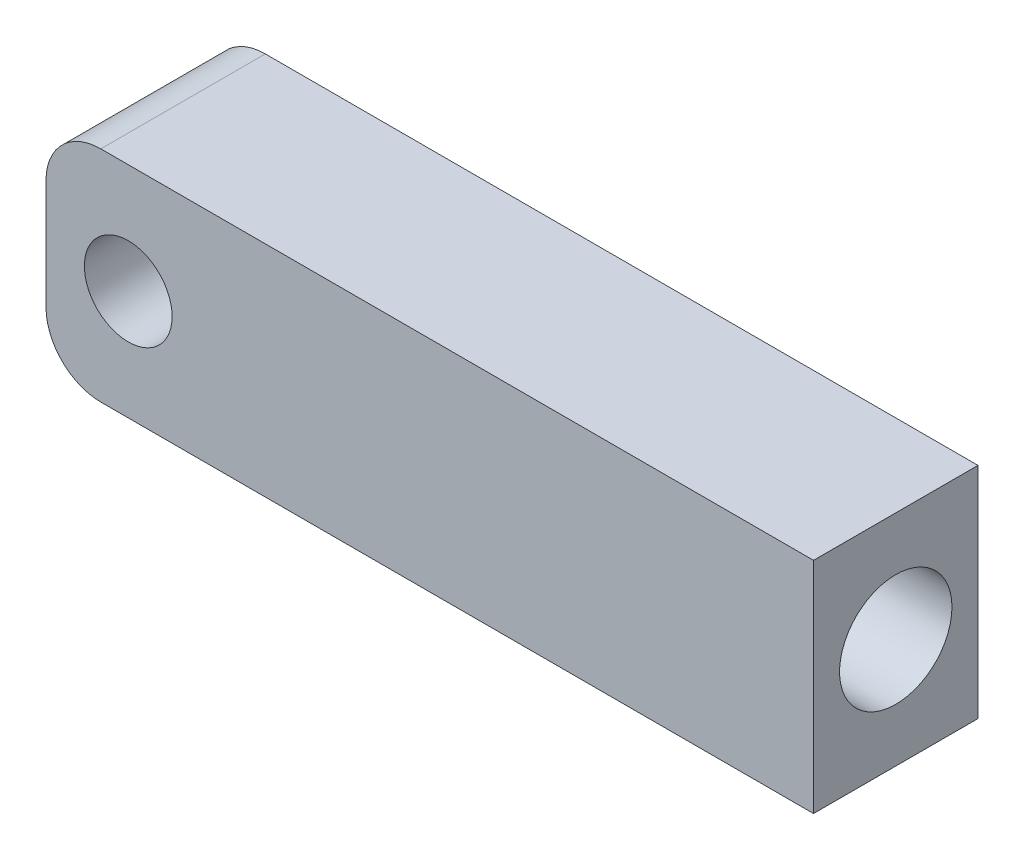
ISO-10303-21;
HEADER;
FILE_DESCRIPTION(('STEP AP214'),'2;1');
FILE_NAME('part.step','',(''),(''),'','','');
FILE_SCHEMA(('AUTOMOTIVE_DESIGN { 1 0 10303 214 1 1 1 1 }'));
ENDSEC;
DATA;
#1=APPLICATION_CONTEXT('core data for automotive mechanical design processes');
#2=APPLICATION_PROTOCOL_DEFINITION('international standard','automotive_design',2000,#1);
#3=PRODUCT_CONTEXT('',#1,'mechanical');
#4=PRODUCT('Part','Part','',(#3));
#5=PRODUCT_RELATED_PRODUCT_CATEGORY('part','',(#4));
#6=PRODUCT_DEFINITION_FORMATION('','',#4);
#7=PRODUCT_DEFINITION_CONTEXT('part definition',#1,'design');
#8=PRODUCT_DEFINITION('design','',#6,#7);
#9=PRODUCT_DEFINITION_SHAPE('','',#8);
#10=(LENGTH_UNIT() NAMED_UNIT(*) SI_UNIT(.MILLI.,.METRE.));
#11=(NAMED_UNIT(*) PLANE_ANGLE_UNIT() SI_UNIT($,.RADIAN.));
#12=(NAMED_UNIT(*) SI_UNIT($,.STERADIAN.) SOLID_ANGLE_UNIT());
#13=UNCERTAINTY_MEASURE_WITH_UNIT(LENGTH_MEASURE(1.E-05),#10,'distance_accuracy_value','');
#14=(GEOMETRIC_REPRESENTATION_CONTEXT(3) GLOBAL_UNCERTAINTY_ASSIGNED_CONTEXT((#13)) GLOBAL_UNIT_ASSIGNED_CONTEXT((#10,
#11,#12)) REPRESENTATION_CONTEXT('',''));
#15=CARTESIAN_POINT('',(0.,0.,0.));
#16=DIRECTION('',(0.,0.,1.));
#17=DIRECTION('',(1.,0.,0.));
#18=AXIS2_PLACEMENT_3D('',#15,#16,#17);
#19=CARTESIAN_POINT('',(2.,2.,6.));
#20=DIRECTION('',(0.,0.,1.));
#21=DIRECTION('',(1.,0.,0.));
#22=AXIS2_PLACEMENT_3D('',#19,#20,#21);
#23=PLANE('',#22);
#24=CARTESIAN_POINT('',(2.,2.,6.));
#25=DIRECTION('',(0.,0.,1.));
#26=DIRECTION('',(1.,0.,0.));
#27=AXIS2_PLACEMENT_3D('',#24,#25,#26);
#28=CIRCLE('',#27,2.);
#29=CARTESIAN_POINT('',(0.,2.00000000000001,6.));
#30=VERTEX_POINT('',#29);
#31=CARTESIAN_POINT('',(2.00000000000001,0.,6.));
#32=VERTEX_POINT('',#31);
#33=EDGE_CURVE('E131',#30,#32,#28,.T.);
#34=ORIENTED_EDGE('',*,*,#33,.T.);
#35=DIRECTION('',(1.,0.,0.));
#36=VECTOR('',#35,1.);
#37=CARTESIAN_POINT('',(28.,0.,6.));
#38=LINE('',#37,#36);
#39=CARTESIAN_POINT('',(28.,0.,6.));
#40=VERTEX_POINT('',#39);
#41=EDGE_CURVE('E89',#32,#40,#38,.T.);
#42=ORIENTED_EDGE('',*,*,#41,.T.);
#43=DIRECTION('',(0.,1.,0.));
#44=VECTOR('',#43,1.);
#45=CARTESIAN_POINT('',(28.,8.,6.));
#46=LINE('',#45,#44);
#47=CARTESIAN_POINT('',(28.,8.,6.));
#48=VERTEX_POINT('',#47);
#49=EDGE_CURVE('E102',#40,#48,#46,.T.);
#50=ORIENTED_EDGE('',*,*,#49,.T.);
#51=DIRECTION('',(-1.,0.,0.));
#52=VECTOR('',#51,1.);
#53=CARTESIAN_POINT('',(2.,8.,6.));
#54=LINE('',#53,#52);
#55=CARTESIAN_POINT('',(2.,8.,6.));
#56=VERTEX_POINT('',#55);
#57=EDGE_CURVE('E96',#48,#56,#54,.T.);
#58=ORIENTED_EDGE('',*,*,#57,.T.);
#59=CARTESIAN_POINT('',(2.,6.,6.));
#60=DIRECTION('',(0.,0.,1.));
#61=DIRECTION('',(-1.,0.,0.));
#62=AXIS2_PLACEMENT_3D('',#59,#60,#61);
#63=CIRCLE('',#62,2.);
#64=CARTESIAN_POINT('',(0.,6.,6.));
#65=VERTEX_POINT('',#64);
#66=EDGE_CURVE('E100',#56,#65,#63,.T.);
#67=ORIENTED_EDGE('',*,*,#66,.T.);
#68=DIRECTION('',(0.,-1.,0.));
#69=VECTOR('',#68,1.);
#70=CARTESIAN_POINT('',(0.,2.00000000000001,6.));
#71=LINE('',#70,#69);
#72=EDGE_CURVE('E52',#65,#30,#71,.T.);
#73=ORIENTED_EDGE('',*,*,#72,.T.);
#74=EDGE_LOOP('',(#34,#42,#50,#58,#67,#73));
#75=FACE_BOUND('',#74,.T.);
#76=CARTESIAN_POINT('',(3.,4.,6.));
#77=DIRECTION('',(0.,0.,1.));
#78=DIRECTION('',(1.,0.,0.));
#79=AXIS2_PLACEMENT_3D('',#76,#77,#78);
#80=CIRCLE('',#79,1.6);
#81=CARTESIAN_POINT('',(4.6,4.,6.));
#82=VERTEX_POINT('',#81);
#83=EDGE_CURVE('E124',#82,#82,#80,.T.);
#84=ORIENTED_EDGE('',*,*,#83,.F.);
#85=EDGE_LOOP('',(#84));
#86=FACE_BOUND('',#85,.T.);
#87=ADVANCED_FACE('F35',(#75,#86),#23,.T.);
#88=CARTESIAN_POINT('',(2.,2.,0.));
#89=DIRECTION('',(0.,0.,1.));
#90=DIRECTION('',(1.,0.,0.));
#91=AXIS2_PLACEMENT_3D('',#88,#89,#90);
#92=PLANE('',#91);
#93=CARTESIAN_POINT('',(2.,2.,0.));
#94=DIRECTION('',(0.,0.,1.));
#95=DIRECTION('',(1.,0.,0.));
#96=AXIS2_PLACEMENT_3D('',#93,#94,#95);
#97=CIRCLE('',#96,2.);
#98=CARTESIAN_POINT('',(0.,2.00000000000001,0.));
#99=VERTEX_POINT('',#98);
#100=CARTESIAN_POINT('',(2.00000000000001,0.,0.));
#101=VERTEX_POINT('',#100);
#102=EDGE_CURVE('E120',#99,#101,#97,.T.);
#103=ORIENTED_EDGE('',*,*,#102,.F.);
#104=DIRECTION('',(0.,-1.,0.));
#105=VECTOR('',#104,1.);
#106=CARTESIAN_POINT('',(0.,2.00000000000001,0.));
#107=LINE('',#106,#105);
#108=CARTESIAN_POINT('',(0.,6.,0.));
#109=VERTEX_POINT('',#108);
#110=EDGE_CURVE('E81',#109,#99,#107,.T.);
#111=ORIENTED_EDGE('',*,*,#110,.F.);
#112=CARTESIAN_POINT('',(2.,6.,0.));
#113=DIRECTION('',(0.,0.,1.));
#114=DIRECTION('',(-1.,0.,0.));
#115=AXIS2_PLACEMENT_3D('',#112,#113,#114);
#116=CIRCLE('',#115,2.);
#117=CARTESIAN_POINT('',(2.,8.,0.));
#118=VERTEX_POINT('',#117);
#119=EDGE_CURVE('E75',#118,#109,#116,.T.);
#120=ORIENTED_EDGE('',*,*,#119,.F.);
#121=DIRECTION('',(-1.,0.,0.));
#122=VECTOR('',#121,1.);
#123=CARTESIAN_POINT('',(2.,8.,0.));
#124=LINE('',#123,#122);
#125=CARTESIAN_POINT('',(28.,8.,0.));
#126=VERTEX_POINT('',#125);
#127=EDGE_CURVE('E110',#126,#118,#124,.T.);
#128=ORIENTED_EDGE('',*,*,#127,.F.);
#129=DIRECTION('',(0.,1.,0.));
#130=VECTOR('',#129,1.);
#131=CARTESIAN_POINT('',(28.,8.,0.));
#132=LINE('',#131,#130);
#133=CARTESIAN_POINT('',(28.,0.,0.));
#134=VERTEX_POINT('',#133);
#135=EDGE_CURVE('E126',#134,#126,#132,.T.);
#136=ORIENTED_EDGE('',*,*,#135,.F.);
#137=DIRECTION('',(1.,0.,0.));
#138=VECTOR('',#137,1.);
#139=CARTESIAN_POINT('',(28.,0.,0.));
#140=LINE('',#139,#138);
#141=EDGE_CURVE('E123',#101,#134,#140,.T.);
#142=ORIENTED_EDGE('',*,*,#141,.F.);
#143=EDGE_LOOP('',(#103,#111,#120,#128,#136,#142));
#144=FACE_BOUND('',#143,.T.);
#145=CARTESIAN_POINT('',(3.,4.,0.));
#146=DIRECTION('',(0.,0.,1.));
#147=DIRECTION('',(1.,0.,0.));
#148=AXIS2_PLACEMENT_3D('',#145,#146,#147);
#149=CIRCLE('',#148,1.6);
#150=CARTESIAN_POINT('',(4.6,4.,0.));
#151=VERTEX_POINT('',#150);
#152=EDGE_CURVE('E175',#151,#151,#149,.T.);
#153=ORIENTED_EDGE('',*,*,#152,.T.);
#154=EDGE_LOOP('',(#153));
#155=FACE_BOUND('',#154,.T.);
#156=ADVANCED_FACE('F140',(#144,#155),#92,.F.);
#157=CARTESIAN_POINT('',(2.,2.,6.));
#158=DIRECTION('',(0.,0.,-1.));
#159=DIRECTION('',(-1.,0.,0.));
#160=AXIS2_PLACEMENT_3D('',#157,#158,#159);
#161=CYLINDRICAL_SURFACE('',#160,2.);
#162=ORIENTED_EDGE('',*,*,#102,.T.);
#163=DIRECTION('',(0.,0.,-1.));
#164=VECTOR('',#163,1.);
#165=CARTESIAN_POINT('',(2.00000000000001,0.,6.));
#166=LINE('',#165,#164);
#167=EDGE_CURVE('E11',#32,#101,#166,.T.);
#168=ORIENTED_EDGE('',*,*,#167,.F.);
#169=ORIENTED_EDGE('',*,*,#33,.F.);
#170=DIRECTION('',(0.,0.,-1.));
#171=VECTOR('',#170,1.);
#172=CARTESIAN_POINT('',(0.,2.00000000000001,6.));
#173=LINE('',#172,#171);
#174=EDGE_CURVE('E116',#30,#99,#173,.T.);
#175=ORIENTED_EDGE('',*,*,#174,.T.);
#176=EDGE_LOOP('',(#162,#168,#169,#175));
#177=FACE_BOUND('',#176,.T.);
#178=ADVANCED_FACE('F37',(#177),#161,.T.);
#179=CARTESIAN_POINT('',(28.,0.,6.));
#180=DIRECTION('',(0.,1.,0.));
#181=DIRECTION('',(-1.,0.,0.));
#182=AXIS2_PLACEMENT_3D('',#179,#180,#181);
#183=PLANE('',#182);
#184=ORIENTED_EDGE('',*,*,#141,.T.);
#185=DIRECTION('',(0.,0.,-1.));
#186=VECTOR('',#185,1.);
#187=CARTESIAN_POINT('',(28.,0.,6.));
#188=LINE('',#187,#186);
#189=EDGE_CURVE('E44',#40,#134,#188,.T.);
#190=ORIENTED_EDGE('',*,*,#189,.F.);
#191=ORIENTED_EDGE('',*,*,#41,.F.);
#192=ORIENTED_EDGE('',*,*,#167,.T.);
#193=EDGE_LOOP('',(#184,#190,#191,#192));
#194=FACE_BOUND('',#193,.T.);
#195=ADVANCED_FACE('F193',(#194),#183,.F.);
#196=CARTESIAN_POINT('',(28.,8.,6.));
#197=DIRECTION('',(-1.,0.,0.));
#198=DIRECTION('',(0.,0.,1.));
#199=AXIS2_PLACEMENT_3D('',#196,#197,#198);
#200=PLANE('',#199);
#201=CARTESIAN_POINT('',(28.,4.,3.));
#202=DIRECTION('',(1.,0.,0.));
#203=DIRECTION('',(0.,0.,-1.));
#204=AXIS2_PLACEMENT_3D('',#201,#202,#203);
#205=CIRCLE('',#204,2.05);
#206=CARTESIAN_POINT('',(28.,4.,0.95));
#207=VERTEX_POINT('',#206);
#208=EDGE_CURVE('E176',#207,#207,#205,.T.);
#209=ORIENTED_EDGE('',*,*,#208,.F.);
#210=EDGE_LOOP('',(#209));
#211=FACE_BOUND('',#210,.T.);
#212=ORIENTED_EDGE('',*,*,#135,.T.);
#213=DIRECTION('',(0.,0.,-1.));
#214=VECTOR('',#213,1.);
#215=CARTESIAN_POINT('',(28.,8.,6.));
#216=LINE('',#215,#214);
#217=EDGE_CURVE('E111',#48,#126,#216,.T.);
#218=ORIENTED_EDGE('',*,*,#217,.F.);
#219=ORIENTED_EDGE('',*,*,#49,.F.);
#220=ORIENTED_EDGE('',*,*,#189,.T.);
#221=EDGE_LOOP('',(#212,#218,#219,#220));
#222=FACE_BOUND('',#221,.T.);
#223=ADVANCED_FACE('F137',(#211,#222),#200,.F.);
#224=CARTESIAN_POINT('',(2.,8.,6.));
#225=DIRECTION('',(0.,-1.,0.));
#226=DIRECTION('',(0.,0.,-1.));
#227=AXIS2_PLACEMENT_3D('',#224,#225,#226);
#228=PLANE('',#227);
#229=ORIENTED_EDGE('',*,*,#127,.T.);
#230=DIRECTION('',(0.,0.,-1.));
#231=VECTOR('',#230,1.);
#232=CARTESIAN_POINT('',(2.,8.,6.));
#233=LINE('',#232,#231);
#234=EDGE_CURVE('E107',#56,#118,#233,.T.);
#235=ORIENTED_EDGE('',*,*,#234,.F.);
#236=ORIENTED_EDGE('',*,*,#57,.F.);
#237=ORIENTED_EDGE('',*,*,#217,.T.);
#238=EDGE_LOOP('',(#229,#235,#236,#237));
#239=FACE_BOUND('',#238,.T.);
#240=ADVANCED_FACE('F108',(#239),#228,.F.);
#241=CARTESIAN_POINT('',(2.,6.,6.));
#242=DIRECTION('',(0.,0.,-1.));
#243=DIRECTION('',(-1.,0.,0.));
#244=AXIS2_PLACEMENT_3D('',#241,#242,#243);
#245=CYLINDRICAL_SURFACE('',#244,2.);
#246=ORIENTED_EDGE('',*,*,#119,.T.);
#247=DIRECTION('',(0.,0.,-1.));
#248=VECTOR('',#247,1.);
#249=CARTESIAN_POINT('',(0.,6.,6.));
#250=LINE('',#249,#248);
#251=EDGE_CURVE('E112',#65,#109,#250,.T.);
#252=ORIENTED_EDGE('',*,*,#251,.F.);
#253=ORIENTED_EDGE('',*,*,#66,.F.);
#254=ORIENTED_EDGE('',*,*,#234,.T.);
#255=EDGE_LOOP('',(#246,#252,#253,#254));
#256=FACE_BOUND('',#255,.T.);
#257=ADVANCED_FACE('F114',(#256),#245,.T.);
#258=CARTESIAN_POINT('',(0.,2.00000000000001,6.));
#259=DIRECTION('',(1.,0.,0.));
#260=DIRECTION('',(0.,0.,-1.));
#261=AXIS2_PLACEMENT_3D('',#258,#259,#260);
#262=PLANE('',#261);
#263=ORIENTED_EDGE('',*,*,#110,.T.);
#264=ORIENTED_EDGE('',*,*,#174,.F.);
#265=ORIENTED_EDGE('',*,*,#72,.F.);
#266=ORIENTED_EDGE('',*,*,#251,.T.);
#267=EDGE_LOOP('',(#263,#264,#265,#266));
#268=FACE_BOUND('',#267,.T.);
#269=ADVANCED_FACE('F145',(#268),#262,.F.);
#270=CARTESIAN_POINT('',(3.,4.,6.));
#271=DIRECTION('',(0.,0.,-1.));
#272=DIRECTION('',(-1.,0.,0.));
#273=AXIS2_PLACEMENT_3D('',#270,#271,#272);
#274=CYLINDRICAL_SURFACE('',#273,1.6);
#275=ORIENTED_EDGE('',*,*,#83,.T.);
#276=EDGE_LOOP('',(#275));
#277=FACE_BOUND('',#276,.T.);
#278=ORIENTED_EDGE('',*,*,#152,.F.);
#279=EDGE_LOOP('',(#278));
#280=FACE_BOUND('',#279,.T.);
#281=ADVANCED_FACE('F147',(#277,#280),#274,.F.);
#282=CARTESIAN_POINT('',(8.,4.,3.));
#283=DIRECTION('',(1.,0.,0.));
#284=DIRECTION('',(0.,0.,-1.));
#285=AXIS2_PLACEMENT_3D('',#282,#283,#284);
#286=CYLINDRICAL_SURFACE('',#285,2.05);
#287=CARTESIAN_POINT('',(8.,4.,3.));
#288=DIRECTION('',(1.,0.,0.));
#289=DIRECTION('',(0.,0.,-1.));
#290=AXIS2_PLACEMENT_3D('',#287,#288,#289);
#291=CIRCLE('',#290,2.05);
#292=CARTESIAN_POINT('',(8.,4.,0.95));
#293=VERTEX_POINT('',#292);
#294=EDGE_CURVE('E174',#293,#293,#291,.T.);
#295=ORIENTED_EDGE('',*,*,#294,.F.);
#296=EDGE_LOOP('',(#295));
#297=FACE_BOUND('',#296,.T.);
#298=ORIENTED_EDGE('',*,*,#208,.T.);
#299=EDGE_LOOP('',(#298));
#300=FACE_BOUND('',#299,.T.);
#301=ADVANCED_FACE('F153',(#297,#300),#286,.F.);
#302=CARTESIAN_POINT('',(8.,4.,3.));
#303=DIRECTION('',(1.,0.,0.));
#304=DIRECTION('',(0.,0.,-1.));
#305=AXIS2_PLACEMENT_3D('',#302,#303,#304);
#306=PLANE('',#305);
#307=ORIENTED_EDGE('',*,*,#294,.T.);
#308=EDGE_LOOP('',(#307));
#309=FACE_BOUND('',#308,.T.);
#310=ADVANCED_FACE('F166',(#309),#306,.T.);
#311=CLOSED_SHELL('',(#87,#156,#178,#195,#223,#240,#257,#269,#281,#301,#310));
#312=MANIFOLD_SOLID_BREP('B2',#311);
#313=ADVANCED_BREP_SHAPE_REPRESENTATION('',(#18,#312),#14);
#314=SHAPE_DEFINITION_REPRESENTATION(#9,#313);
ENDSEC;
END-ISO-10303-21;
